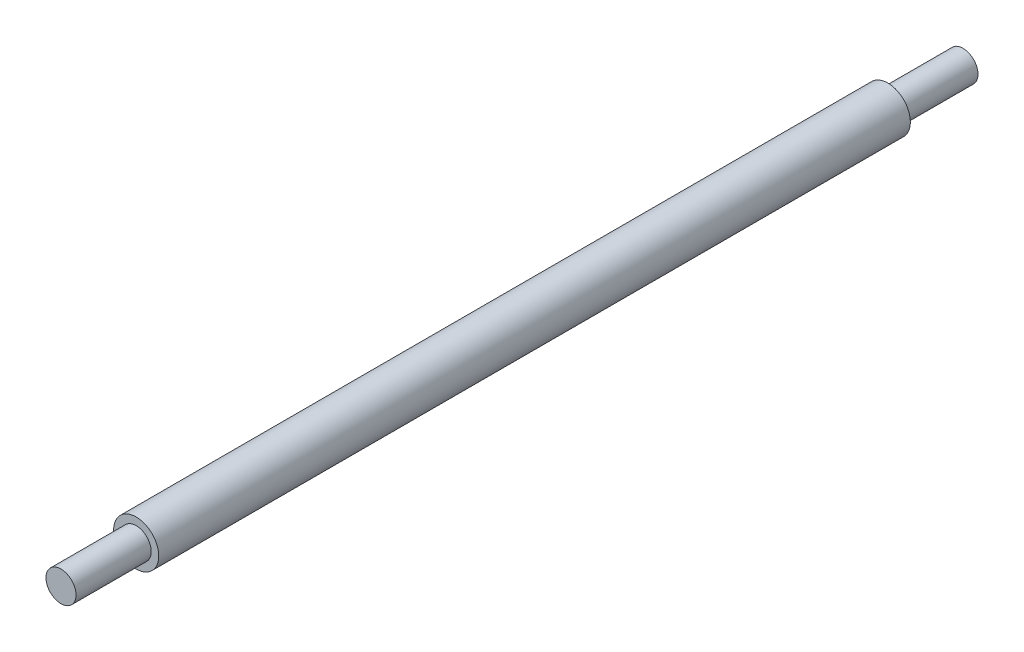
ISO-10303-21;
HEADER;
FILE_DESCRIPTION(('STEP AP214'),'2;1');
FILE_NAME('part.step','',(''),(''),'','','');
FILE_SCHEMA(('AUTOMOTIVE_DESIGN { 1 0 10303 214 1 1 1 1 }'));
ENDSEC;
DATA;
#1=APPLICATION_CONTEXT('core data for automotive mechanical design processes');
#2=APPLICATION_PROTOCOL_DEFINITION('international standard','automotive_design',2000,#1);
#3=PRODUCT_CONTEXT('',#1,'mechanical');
#4=PRODUCT('Part','Part','',(#3));
#5=PRODUCT_RELATED_PRODUCT_CATEGORY('part','',(#4));
#6=PRODUCT_DEFINITION_FORMATION('','',#4);
#7=PRODUCT_DEFINITION_CONTEXT('part definition',#1,'design');
#8=PRODUCT_DEFINITION('design','',#6,#7);
#9=PRODUCT_DEFINITION_SHAPE('','',#8);
#10=(LENGTH_UNIT() NAMED_UNIT(*) SI_UNIT(.MILLI.,.METRE.));
#11=(NAMED_UNIT(*) PLANE_ANGLE_UNIT() SI_UNIT($,.RADIAN.));
#12=(NAMED_UNIT(*) SI_UNIT($,.STERADIAN.) SOLID_ANGLE_UNIT());
#13=UNCERTAINTY_MEASURE_WITH_UNIT(LENGTH_MEASURE(1.E-05),#10,'distance_accuracy_value','');
#14=(GEOMETRIC_REPRESENTATION_CONTEXT(3) GLOBAL_UNCERTAINTY_ASSIGNED_CONTEXT((#13)) GLOBAL_UNIT_ASSIGNED_CONTEXT((#10,
#11,#12)) REPRESENTATION_CONTEXT('',''));
#15=CARTESIAN_POINT('',(0.,0.,0.));
#16=DIRECTION('',(0.,0.,1.));
#17=DIRECTION('',(1.,0.,0.));
#18=AXIS2_PLACEMENT_3D('',#15,#16,#17);
#19=CARTESIAN_POINT('',(0.,0.,0.));
#20=DIRECTION('',(0.,0.,1.));
#21=DIRECTION('',(1.,0.,0.));
#22=AXIS2_PLACEMENT_3D('',#19,#20,#21);
#23=PLANE('',#22);
#24=CARTESIAN_POINT('',(0.,0.,0.));
#25=DIRECTION('',(0.,0.,1.));
#26=DIRECTION('',(1.,0.,0.));
#27=AXIS2_PLACEMENT_3D('',#24,#25,#26);
#28=CIRCLE('',#27,19.05);
#29=CARTESIAN_POINT('',(19.05,0.,0.));
#30=VERTEX_POINT('',#29);
#31=EDGE_CURVE('E41',#30,#30,#28,.T.);
#32=ORIENTED_EDGE('',*,*,#31,.F.);
#33=EDGE_LOOP('',(#32));
#34=FACE_BOUND('',#33,.T.);
#35=CARTESIAN_POINT('',(0.,0.,0.));
#36=DIRECTION('',(0.,0.,1.));
#37=DIRECTION('',(1.,0.,0.));
#38=AXIS2_PLACEMENT_3D('',#35,#36,#37);
#39=CIRCLE('',#38,12.7);
#40=CARTESIAN_POINT('',(12.7,0.,0.));
#41=VERTEX_POINT('',#40);
#42=EDGE_CURVE('E10',#41,#41,#39,.F.);
#43=ORIENTED_EDGE('',*,*,#42,.F.);
#44=EDGE_LOOP('',(#43));
#45=FACE_BOUND('',#44,.T.);
#46=ADVANCED_FACE('F30',(#34,#45),#23,.F.);
#47=CARTESIAN_POINT('',(0.,0.,635.));
#48=DIRECTION('',(0.,0.,1.));
#49=DIRECTION('',(1.,0.,0.));
#50=AXIS2_PLACEMENT_3D('',#47,#48,#49);
#51=PLANE('',#50);
#52=CARTESIAN_POINT('',(0.,0.,635.));
#53=DIRECTION('',(0.,0.,1.));
#54=DIRECTION('',(1.,0.,0.));
#55=AXIS2_PLACEMENT_3D('',#52,#53,#54);
#56=CIRCLE('',#55,19.05);
#57=CARTESIAN_POINT('',(19.05,0.,635.));
#58=VERTEX_POINT('',#57);
#59=EDGE_CURVE('E37',#58,#58,#56,.T.);
#60=ORIENTED_EDGE('',*,*,#59,.T.);
#61=EDGE_LOOP('',(#60));
#62=FACE_BOUND('',#61,.T.);
#63=CARTESIAN_POINT('',(0.,0.,635.));
#64=DIRECTION('',(0.,0.,1.));
#65=DIRECTION('',(1.,0.,0.));
#66=AXIS2_PLACEMENT_3D('',#63,#64,#65);
#67=CIRCLE('',#66,12.7);
#68=CARTESIAN_POINT('',(12.7,0.,635.));
#69=VERTEX_POINT('',#68);
#70=EDGE_CURVE('E48',#69,#69,#67,.T.);
#71=ORIENTED_EDGE('',*,*,#70,.F.);
#72=EDGE_LOOP('',(#71));
#73=FACE_BOUND('',#72,.T.);
#74=ADVANCED_FACE('F72',(#62,#73),#51,.T.);
#75=CARTESIAN_POINT('',(0.,0.,635.));
#76=DIRECTION('',(0.,0.,-1.));
#77=DIRECTION('',(-1.,0.,0.));
#78=AXIS2_PLACEMENT_3D('',#75,#76,#77);
#79=CYLINDRICAL_SURFACE('',#78,19.05);
#80=ORIENTED_EDGE('',*,*,#59,.F.);
#81=EDGE_LOOP('',(#80));
#82=FACE_BOUND('',#81,.T.);
#83=ORIENTED_EDGE('',*,*,#31,.T.);
#84=EDGE_LOOP('',(#83));
#85=FACE_BOUND('',#84,.T.);
#86=ADVANCED_FACE('F32',(#82,#85),#79,.T.);
#87=CARTESIAN_POINT('',(0.,0.,698.5));
#88=DIRECTION('',(0.,0.,-1.));
#89=DIRECTION('',(-1.,0.,0.));
#90=AXIS2_PLACEMENT_3D('',#87,#88,#89);
#91=CYLINDRICAL_SURFACE('',#90,12.7);
#92=CARTESIAN_POINT('',(0.,0.,698.5));
#93=DIRECTION('',(0.,0.,1.));
#94=DIRECTION('',(1.,0.,0.));
#95=AXIS2_PLACEMENT_3D('',#92,#93,#94);
#96=CIRCLE('',#95,12.7);
#97=CARTESIAN_POINT('',(12.7,0.,698.5));
#98=VERTEX_POINT('',#97);
#99=EDGE_CURVE('E46',#98,#98,#96,.T.);
#100=ORIENTED_EDGE('',*,*,#99,.F.);
#101=EDGE_LOOP('',(#100));
#102=FACE_BOUND('',#101,.T.);
#103=ORIENTED_EDGE('',*,*,#70,.T.);
#104=EDGE_LOOP('',(#103));
#105=FACE_BOUND('',#104,.T.);
#106=ADVANCED_FACE('F68',(#102,#105),#91,.T.);
#107=CARTESIAN_POINT('',(0.,0.,698.5));
#108=DIRECTION('',(0.,0.,1.));
#109=DIRECTION('',(1.,0.,0.));
#110=AXIS2_PLACEMENT_3D('',#107,#108,#109);
#111=PLANE('',#110);
#112=ORIENTED_EDGE('',*,*,#99,.T.);
#113=EDGE_LOOP('',(#112));
#114=FACE_BOUND('',#113,.T.);
#115=ADVANCED_FACE('F61',(#114),#111,.T.);
#116=CARTESIAN_POINT('',(0.,0.,-63.5));
#117=DIRECTION('',(0.,0.,1.));
#118=DIRECTION('',(1.,0.,0.));
#119=AXIS2_PLACEMENT_3D('',#116,#117,#118);
#120=CYLINDRICAL_SURFACE('',#119,12.7);
#121=CARTESIAN_POINT('',(0.,0.,-63.5));
#122=DIRECTION('',(0.,0.,-1.));
#123=DIRECTION('',(-1.,0.,0.));
#124=AXIS2_PLACEMENT_3D('',#121,#122,#123);
#125=CIRCLE('',#124,12.7);
#126=CARTESIAN_POINT('',(-12.7,0.,-63.5));
#127=VERTEX_POINT('',#126);
#128=EDGE_CURVE('E51',#127,#127,#125,.T.);
#129=ORIENTED_EDGE('',*,*,#128,.F.);
#130=EDGE_LOOP('',(#129));
#131=FACE_BOUND('',#130,.T.);
#132=ORIENTED_EDGE('',*,*,#42,.T.);
#133=EDGE_LOOP('',(#132));
#134=FACE_BOUND('',#133,.T.);
#135=ADVANCED_FACE('F59',(#131,#134),#120,.T.);
#136=CARTESIAN_POINT('',(0.,0.,-63.5));
#137=DIRECTION('',(0.,0.,-1.));
#138=DIRECTION('',(-1.,0.,0.));
#139=AXIS2_PLACEMENT_3D('',#136,#137,#138);
#140=PLANE('',#139);
#141=ORIENTED_EDGE('',*,*,#128,.T.);
#142=EDGE_LOOP('',(#141));
#143=FACE_BOUND('',#142,.T.);
#144=ADVANCED_FACE('F57',(#143),#140,.T.);
#145=CLOSED_SHELL('',(#46,#74,#86,#106,#115,#135,#144));
#146=MANIFOLD_SOLID_BREP('B2',#145);
#147=ADVANCED_BREP_SHAPE_REPRESENTATION('',(#18,#146),#14);
#148=SHAPE_DEFINITION_REPRESENTATION(#9,#147);
ENDSEC;
END-ISO-10303-21;
